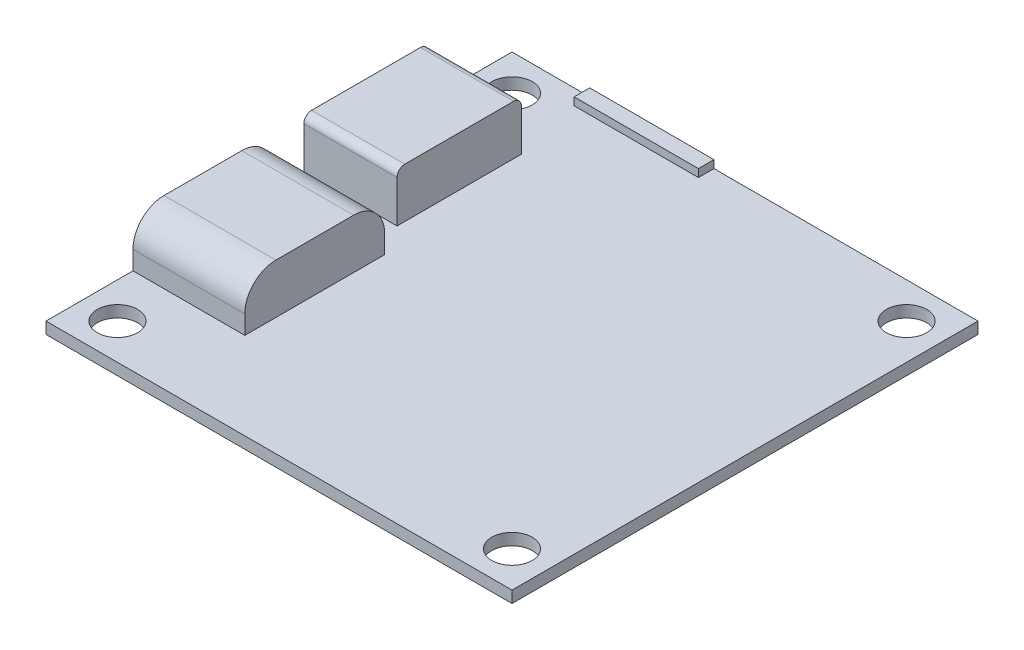
ISO-10303-21;
HEADER;
FILE_DESCRIPTION(('STEP AP214'),'2;1');
FILE_NAME('part.step','',(''),(''),'','','');
FILE_SCHEMA(('AUTOMOTIVE_DESIGN { 1 0 10303 214 1 1 1 1 }'));
ENDSEC;
DATA;
#1=APPLICATION_CONTEXT('core data for automotive mechanical design processes');
#2=APPLICATION_PROTOCOL_DEFINITION('international standard','automotive_design',2000,#1);
#3=PRODUCT_CONTEXT('',#1,'mechanical');
#4=PRODUCT('Part','Part','',(#3));
#5=PRODUCT_RELATED_PRODUCT_CATEGORY('part','',(#4));
#6=PRODUCT_DEFINITION_FORMATION('','',#4);
#7=PRODUCT_DEFINITION_CONTEXT('part definition',#1,'design');
#8=PRODUCT_DEFINITION('design','',#6,#7);
#9=PRODUCT_DEFINITION_SHAPE('','',#8);
#10=(LENGTH_UNIT() NAMED_UNIT(*) SI_UNIT(.MILLI.,.METRE.));
#11=(NAMED_UNIT(*) PLANE_ANGLE_UNIT() SI_UNIT($,.RADIAN.));
#12=(NAMED_UNIT(*) SI_UNIT($,.STERADIAN.) SOLID_ANGLE_UNIT());
#13=UNCERTAINTY_MEASURE_WITH_UNIT(LENGTH_MEASURE(1.E-05),#10,'distance_accuracy_value','');
#14=(GEOMETRIC_REPRESENTATION_CONTEXT(3) GLOBAL_UNCERTAINTY_ASSIGNED_CONTEXT((#13)) GLOBAL_UNIT_ASSIGNED_CONTEXT((#10,
#11,#12)) REPRESENTATION_CONTEXT('',''));
#15=CARTESIAN_POINT('',(0.,0.,0.));
#16=DIRECTION('',(0.,0.,1.));
#17=DIRECTION('',(1.,0.,0.));
#18=AXIS2_PLACEMENT_3D('',#15,#16,#17);
#19=CARTESIAN_POINT('',(0.,0.375,0.));
#20=DIRECTION('',(0.,1.,0.));
#21=DIRECTION('',(0.,0.,1.));
#22=AXIS2_PLACEMENT_3D('',#19,#20,#21);
#23=PLANE('',#22);
#24=CARTESIAN_POINT('',(12.7,0.375,12.7));
#25=DIRECTION('',(0.,1.,0.));
#26=DIRECTION('',(0.,0.,-1.));
#27=AXIS2_PLACEMENT_3D('',#24,#25,#26);
#28=CIRCLE('',#27,1.3);
#29=CARTESIAN_POINT('',(12.7,0.375,11.4));
#30=VERTEX_POINT('',#29);
#31=EDGE_CURVE('E279',#30,#30,#28,.T.);
#32=ORIENTED_EDGE('',*,*,#31,.F.);
#33=EDGE_LOOP('',(#32));
#34=FACE_BOUND('',#33,.T.);
#35=CARTESIAN_POINT('',(-12.7,0.375,12.7));
#36=DIRECTION('',(0.,-1.,0.));
#37=DIRECTION('',(0.,0.,-1.));
#38=AXIS2_PLACEMENT_3D('',#35,#36,#37);
#39=CIRCLE('',#38,1.3);
#40=CARTESIAN_POINT('',(-12.7,0.375,11.4));
#41=VERTEX_POINT('',#40);
#42=EDGE_CURVE('E284',#41,#41,#39,.T.);
#43=ORIENTED_EDGE('',*,*,#42,.T.);
#44=EDGE_LOOP('',(#43));
#45=FACE_BOUND('',#44,.T.);
#46=CARTESIAN_POINT('',(12.7,0.375,-12.7));
#47=DIRECTION('',(0.,-1.,0.));
#48=DIRECTION('',(0.,0.,1.));
#49=AXIS2_PLACEMENT_3D('',#46,#47,#48);
#50=CIRCLE('',#49,1.3);
#51=CARTESIAN_POINT('',(12.7,0.375,-11.4));
#52=VERTEX_POINT('',#51);
#53=EDGE_CURVE('E292',#52,#52,#50,.T.);
#54=ORIENTED_EDGE('',*,*,#53,.T.);
#55=EDGE_LOOP('',(#54));
#56=FACE_BOUND('',#55,.T.);
#57=CARTESIAN_POINT('',(-12.7,0.375,-12.7));
#58=DIRECTION('',(0.,1.,0.));
#59=DIRECTION('',(0.,0.,1.));
#60=AXIS2_PLACEMENT_3D('',#57,#58,#59);
#61=CIRCLE('',#60,1.3);
#62=CARTESIAN_POINT('',(-12.7,0.375,-11.4));
#63=VERTEX_POINT('',#62);
#64=EDGE_CURVE('E300',#63,#63,#61,.T.);
#65=ORIENTED_EDGE('',*,*,#64,.F.);
#66=EDGE_LOOP('',(#65));
#67=FACE_BOUND('',#66,.T.);
#68=DIRECTION('',(-1.,0.,0.));
#69=VECTOR('',#68,1.);
#70=CARTESIAN_POINT('',(0.,0.375,-14.));
#71=LINE('',#70,#69);
#72=CARTESIAN_POINT('',(-1.99999999999999,0.375,-14.));
#73=VERTEX_POINT('',#72);
#74=CARTESIAN_POINT('',(-9.99999999999999,0.375,-14.));
#75=VERTEX_POINT('',#74);
#76=EDGE_CURVE('E11',#73,#75,#71,.T.);
#77=ORIENTED_EDGE('',*,*,#76,.T.);
#78=DIRECTION('',(0.,0.,-1.));
#79=VECTOR('',#78,1.);
#80=CARTESIAN_POINT('',(-9.99999999999999,0.375,0.));
#81=LINE('',#80,#79);
#82=CARTESIAN_POINT('',(-9.99999999999999,0.375,-15.));
#83=VERTEX_POINT('',#82);
#84=EDGE_CURVE('E203',#75,#83,#81,.T.);
#85=ORIENTED_EDGE('',*,*,#84,.T.);
#86=DIRECTION('',(-1.,0.,0.));
#87=VECTOR('',#86,1.);
#88=CARTESIAN_POINT('',(-15.,0.375,-15.));
#89=LINE('',#88,#87);
#90=CARTESIAN_POINT('',(-15.,0.375,-15.));
#91=VERTEX_POINT('',#90);
#92=EDGE_CURVE('E316',#83,#91,#89,.T.);
#93=ORIENTED_EDGE('',*,*,#92,.T.);
#94=DIRECTION('',(0.,0.,1.));
#95=VECTOR('',#94,1.);
#96=CARTESIAN_POINT('',(-15.,0.375,-15.));
#97=LINE('',#96,#95);
#98=CARTESIAN_POINT('',(-15.,0.375,-9.6));
#99=VERTEX_POINT('',#98);
#100=EDGE_CURVE('E322',#91,#99,#97,.T.);
#101=ORIENTED_EDGE('',*,*,#100,.T.);
#102=DIRECTION('',(-1.,0.,0.));
#103=VECTOR('',#102,1.);
#104=CARTESIAN_POINT('',(-15.,0.375,-9.6));
#105=LINE('',#104,#103);
#106=CARTESIAN_POINT('',(-9.,0.375,-9.6));
#107=VERTEX_POINT('',#106);
#108=EDGE_CURVE('E221',#107,#99,#105,.T.);
#109=ORIENTED_EDGE('',*,*,#108,.F.);
#110=DIRECTION('',(0.,0.,-1.));
#111=VECTOR('',#110,1.);
#112=CARTESIAN_POINT('',(-9.,0.375,-1.6));
#113=LINE('',#112,#111);
#114=CARTESIAN_POINT('',(-9.,0.375,-1.6));
#115=VERTEX_POINT('',#114);
#116=EDGE_CURVE('E229',#115,#107,#113,.T.);
#117=ORIENTED_EDGE('',*,*,#116,.F.);
#118=DIRECTION('',(1.,0.,0.));
#119=VECTOR('',#118,1.);
#120=CARTESIAN_POINT('',(-15.,0.375,-1.6));
#121=LINE('',#120,#119);
#122=CARTESIAN_POINT('',(-15.,0.375,-1.6));
#123=VERTEX_POINT('',#122);
#124=EDGE_CURVE('E215',#123,#115,#121,.T.);
#125=ORIENTED_EDGE('',*,*,#124,.F.);
#126=CARTESIAN_POINT('',(-15.,0.375,0.399999999999998));
#127=VERTEX_POINT('',#126);
#128=EDGE_CURVE('E327',#123,#127,#97,.T.);
#129=ORIENTED_EDGE('',*,*,#128,.T.);
#130=DIRECTION('',(-1.,0.,0.));
#131=VECTOR('',#130,1.);
#132=CARTESIAN_POINT('',(-15.,0.375,0.400000000000001));
#133=LINE('',#132,#131);
#134=CARTESIAN_POINT('',(-7.79999999999999,0.375,0.400000000000001));
#135=VERTEX_POINT('',#134);
#136=EDGE_CURVE('E253',#135,#127,#133,.T.);
#137=ORIENTED_EDGE('',*,*,#136,.F.);
#138=DIRECTION('',(0.,0.,-1.));
#139=VECTOR('',#138,1.);
#140=CARTESIAN_POINT('',(-7.79999999999999,0.375,9.4));
#141=LINE('',#140,#139);
#142=CARTESIAN_POINT('',(-7.79999999999999,0.375,9.4));
#143=VERTEX_POINT('',#142);
#144=EDGE_CURVE('E261',#143,#135,#141,.T.);
#145=ORIENTED_EDGE('',*,*,#144,.F.);
#146=DIRECTION('',(1.,0.,0.));
#147=VECTOR('',#146,1.);
#148=CARTESIAN_POINT('',(-15.,0.375,9.4));
#149=LINE('',#148,#147);
#150=CARTESIAN_POINT('',(-15.,0.375,9.39999999999999));
#151=VERTEX_POINT('',#150);
#152=EDGE_CURVE('E247',#151,#143,#149,.T.);
#153=ORIENTED_EDGE('',*,*,#152,.F.);
#154=CARTESIAN_POINT('',(-15.,0.375,15.));
#155=VERTEX_POINT('',#154);
#156=EDGE_CURVE('E321',#151,#155,#97,.T.);
#157=ORIENTED_EDGE('',*,*,#156,.T.);
#158=DIRECTION('',(1.,0.,0.));
#159=VECTOR('',#158,1.);
#160=CARTESIAN_POINT('',(-15.,0.375,15.));
#161=LINE('',#160,#159);
#162=CARTESIAN_POINT('',(15.,0.375,15.));
#163=VERTEX_POINT('',#162);
#164=EDGE_CURVE('E326',#155,#163,#161,.T.);
#165=ORIENTED_EDGE('',*,*,#164,.T.);
#166=DIRECTION('',(0.,0.,-1.));
#167=VECTOR('',#166,1.);
#168=CARTESIAN_POINT('',(15.,0.375,-15.));
#169=LINE('',#168,#167);
#170=CARTESIAN_POINT('',(15.,0.375,-15.));
#171=VERTEX_POINT('',#170);
#172=EDGE_CURVE('E312',#163,#171,#169,.T.);
#173=ORIENTED_EDGE('',*,*,#172,.T.);
#174=CARTESIAN_POINT('',(-2.,0.375,-15.));
#175=VERTEX_POINT('',#174);
#176=EDGE_CURVE('E318',#171,#175,#89,.T.);
#177=ORIENTED_EDGE('',*,*,#176,.T.);
#178=DIRECTION('',(0.,0.,1.));
#179=VECTOR('',#178,1.);
#180=CARTESIAN_POINT('',(-1.99999999999999,0.375,0.));
#181=LINE('',#180,#179);
#182=EDGE_CURVE('E64',#175,#73,#181,.T.);
#183=ORIENTED_EDGE('',*,*,#182,.T.);
#184=EDGE_LOOP('',(#77,#85,#93,#101,#109,#117,#125,#129,#137,#145,#153,#157,#165,#173,#177,#183));
#185=FACE_BOUND('',#184,.T.);
#186=ADVANCED_FACE('F45',(#34,#45,#56,#67,#185),#23,.T.);
#187=CARTESIAN_POINT('',(15.,0.375,-15.));
#188=DIRECTION('',(-1.,0.,0.));
#189=DIRECTION('',(0.,0.,1.));
#190=AXIS2_PLACEMENT_3D('',#187,#188,#189);
#191=PLANE('',#190);
#192=DIRECTION('',(0.,0.,-1.));
#193=VECTOR('',#192,1.);
#194=CARTESIAN_POINT('',(15.,-0.375,-15.));
#195=LINE('',#194,#193);
#196=CARTESIAN_POINT('',(15.,-0.375,15.));
#197=VERTEX_POINT('',#196);
#198=CARTESIAN_POINT('',(15.,-0.375,-15.));
#199=VERTEX_POINT('',#198);
#200=EDGE_CURVE('E308',#197,#199,#195,.T.);
#201=ORIENTED_EDGE('',*,*,#200,.T.);
#202=DIRECTION('',(0.,-1.,0.));
#203=VECTOR('',#202,1.);
#204=CARTESIAN_POINT('',(15.,0.375,-15.));
#205=LINE('',#204,#203);
#206=EDGE_CURVE('E353',#171,#199,#205,.T.);
#207=ORIENTED_EDGE('',*,*,#206,.F.);
#208=ORIENTED_EDGE('',*,*,#172,.F.);
#209=DIRECTION('',(0.,-1.,0.));
#210=VECTOR('',#209,1.);
#211=CARTESIAN_POINT('',(15.,0.375,15.));
#212=LINE('',#211,#210);
#213=EDGE_CURVE('E330',#163,#197,#212,.T.);
#214=ORIENTED_EDGE('',*,*,#213,.T.);
#215=EDGE_LOOP('',(#201,#207,#208,#214));
#216=FACE_BOUND('',#215,.T.);
#217=ADVANCED_FACE('F451',(#216),#191,.F.);
#218=CARTESIAN_POINT('',(-15.,0.375,-15.));
#219=DIRECTION('',(0.,0.,1.));
#220=DIRECTION('',(1.,0.,0.));
#221=AXIS2_PLACEMENT_3D('',#218,#219,#220);
#222=PLANE('',#221);
#223=ORIENTED_EDGE('',*,*,#92,.F.);
#224=DIRECTION('',(0.,-1.,0.));
#225=VECTOR('',#224,1.);
#226=CARTESIAN_POINT('',(-9.99999999999999,0.875,-15.));
#227=LINE('',#226,#225);
#228=CARTESIAN_POINT('',(-9.99999999999999,0.875,-15.));
#229=VERTEX_POINT('',#228);
#230=EDGE_CURVE('E639',#229,#83,#227,.T.);
#231=ORIENTED_EDGE('',*,*,#230,.F.);
#232=DIRECTION('',(-1.,0.,0.));
#233=VECTOR('',#232,1.);
#234=CARTESIAN_POINT('',(-9.99999999999999,0.875,-15.));
#235=LINE('',#234,#233);
#236=CARTESIAN_POINT('',(-1.99999999999999,0.875,-15.));
#237=VERTEX_POINT('',#236);
#238=EDGE_CURVE('E196',#237,#229,#235,.T.);
#239=ORIENTED_EDGE('',*,*,#238,.F.);
#240=DIRECTION('',(0.,-1.,0.));
#241=VECTOR('',#240,1.);
#242=CARTESIAN_POINT('',(-1.99999999999999,0.875,-15.));
#243=LINE('',#242,#241);
#244=EDGE_CURVE('E209',#237,#175,#243,.T.);
#245=ORIENTED_EDGE('',*,*,#244,.T.);
#246=ORIENTED_EDGE('',*,*,#176,.F.);
#247=ORIENTED_EDGE('',*,*,#206,.T.);
#248=DIRECTION('',(-1.,0.,0.));
#249=VECTOR('',#248,1.);
#250=CARTESIAN_POINT('',(-15.,-0.375,-15.));
#251=LINE('',#250,#249);
#252=CARTESIAN_POINT('',(-15.,-0.375,-15.));
#253=VERTEX_POINT('',#252);
#254=EDGE_CURVE('E334',#199,#253,#251,.T.);
#255=ORIENTED_EDGE('',*,*,#254,.T.);
#256=DIRECTION('',(0.,-1.,0.));
#257=VECTOR('',#256,1.);
#258=CARTESIAN_POINT('',(-15.,0.375,-15.));
#259=LINE('',#258,#257);
#260=EDGE_CURVE('E349',#91,#253,#259,.T.);
#261=ORIENTED_EDGE('',*,*,#260,.F.);
#262=EDGE_LOOP('',(#223,#231,#239,#245,#246,#247,#255,#261));
#263=FACE_BOUND('',#262,.T.);
#264=ADVANCED_FACE('F502',(#263),#222,.F.);
#265=CARTESIAN_POINT('',(-15.,0.375,-15.));
#266=DIRECTION('',(1.,0.,0.));
#267=DIRECTION('',(0.,0.,-1.));
#268=AXIS2_PLACEMENT_3D('',#265,#266,#267);
#269=PLANE('',#268);
#270=DIRECTION('',(0.,0.,1.));
#271=VECTOR('',#270,1.);
#272=CARTESIAN_POINT('',(-15.,3.575,-1.6));
#273=LINE('',#272,#271);
#274=CARTESIAN_POINT('',(-15.,3.575,-9.1));
#275=VERTEX_POINT('',#274);
#276=CARTESIAN_POINT('',(-15.,3.575,-2.1));
#277=VERTEX_POINT('',#276);
#278=EDGE_CURVE('E216',#275,#277,#273,.T.);
#279=ORIENTED_EDGE('',*,*,#278,.F.);
#280=CARTESIAN_POINT('',(-15.,3.075,-9.1));
#281=DIRECTION('',(1.,0.,0.));
#282=DIRECTION('',(0.,0.,-1.));
#283=AXIS2_PLACEMENT_3D('',#280,#281,#282);
#284=CIRCLE('',#283,0.5);
#285=CARTESIAN_POINT('',(-15.,3.075,-9.6));
#286=VERTEX_POINT('',#285);
#287=EDGE_CURVE('E394',#275,#286,#284,.F.);
#288=ORIENTED_EDGE('',*,*,#287,.T.);
#289=DIRECTION('',(0.,-1.,0.));
#290=VECTOR('',#289,1.);
#291=CARTESIAN_POINT('',(-15.,3.575,-9.6));
#292=LINE('',#291,#290);
#293=EDGE_CURVE('E225',#286,#99,#292,.T.);
#294=ORIENTED_EDGE('',*,*,#293,.T.);
#295=ORIENTED_EDGE('',*,*,#100,.F.);
#296=ORIENTED_EDGE('',*,*,#260,.T.);
#297=DIRECTION('',(0.,0.,1.));
#298=VECTOR('',#297,1.);
#299=CARTESIAN_POINT('',(-15.,-0.375,-15.));
#300=LINE('',#299,#298);
#301=CARTESIAN_POINT('',(-15.,-0.375,15.));
#302=VERTEX_POINT('',#301);
#303=EDGE_CURVE('E337',#253,#302,#300,.T.);
#304=ORIENTED_EDGE('',*,*,#303,.T.);
#305=DIRECTION('',(0.,-1.,0.));
#306=VECTOR('',#305,1.);
#307=CARTESIAN_POINT('',(-15.,0.375,15.));
#308=LINE('',#307,#306);
#309=EDGE_CURVE('E345',#155,#302,#308,.T.);
#310=ORIENTED_EDGE('',*,*,#309,.F.);
#311=ORIENTED_EDGE('',*,*,#156,.F.);
#312=DIRECTION('',(0.,-1.,0.));
#313=VECTOR('',#312,1.);
#314=CARTESIAN_POINT('',(-15.,3.575,9.4));
#315=LINE('',#314,#313);
#316=CARTESIAN_POINT('',(-15.,1.575,9.4));
#317=VERTEX_POINT('',#316);
#318=EDGE_CURVE('E276',#317,#151,#315,.T.);
#319=ORIENTED_EDGE('',*,*,#318,.F.);
#320=CARTESIAN_POINT('',(-15.,1.575,7.4));
#321=DIRECTION('',(1.,0.,0.));
#322=DIRECTION('',(0.,0.,-1.));
#323=AXIS2_PLACEMENT_3D('',#320,#321,#322);
#324=CIRCLE('',#323,2.);
#325=CARTESIAN_POINT('',(-15.,3.575,7.4));
#326=VERTEX_POINT('',#325);
#327=EDGE_CURVE('E365',#317,#326,#324,.F.);
#328=ORIENTED_EDGE('',*,*,#327,.T.);
#329=DIRECTION('',(0.,0.,1.));
#330=VECTOR('',#329,1.);
#331=CARTESIAN_POINT('',(-15.,3.575,9.4));
#332=LINE('',#331,#330);
#333=CARTESIAN_POINT('',(-15.,3.575,2.4));
#334=VERTEX_POINT('',#333);
#335=EDGE_CURVE('E248',#334,#326,#332,.T.);
#336=ORIENTED_EDGE('',*,*,#335,.F.);
#337=CARTESIAN_POINT('',(-15.,1.575,2.4));
#338=DIRECTION('',(1.,0.,0.));
#339=DIRECTION('',(0.,0.,-1.));
#340=AXIS2_PLACEMENT_3D('',#337,#338,#339);
#341=CIRCLE('',#340,2.);
#342=CARTESIAN_POINT('',(-15.,1.575,0.400000000000001));
#343=VERTEX_POINT('',#342);
#344=EDGE_CURVE('E368',#334,#343,#341,.F.);
#345=ORIENTED_EDGE('',*,*,#344,.T.);
#346=DIRECTION('',(0.,-1.,0.));
#347=VECTOR('',#346,1.);
#348=CARTESIAN_POINT('',(-15.,3.575,0.400000000000001));
#349=LINE('',#348,#347);
#350=EDGE_CURVE('E257',#343,#127,#349,.T.);
#351=ORIENTED_EDGE('',*,*,#350,.T.);
#352=ORIENTED_EDGE('',*,*,#128,.F.);
#353=DIRECTION('',(0.,-1.,0.));
#354=VECTOR('',#353,1.);
#355=CARTESIAN_POINT('',(-15.,3.575,-1.6));
#356=LINE('',#355,#354);
#357=CARTESIAN_POINT('',(-15.,3.075,-1.6));
#358=VERTEX_POINT('',#357);
#359=EDGE_CURVE('E244',#358,#123,#356,.T.);
#360=ORIENTED_EDGE('',*,*,#359,.F.);
#361=CARTESIAN_POINT('',(-15.,3.075,-2.1));
#362=DIRECTION('',(1.,0.,0.));
#363=DIRECTION('',(0.,0.,-1.));
#364=AXIS2_PLACEMENT_3D('',#361,#362,#363);
#365=CIRCLE('',#364,0.5);
#366=EDGE_CURVE('E391',#358,#277,#365,.F.);
#367=ORIENTED_EDGE('',*,*,#366,.T.);
#368=EDGE_LOOP('',(#279,#288,#294,#295,#296,#304,#310,#311,#319,#328,#336,#345,#351,#352,#360,#367));
#369=FACE_BOUND('',#368,.T.);
#370=ADVANCED_FACE('F417',(#369),#269,.F.);
#371=CARTESIAN_POINT('',(-15.,0.375,15.));
#372=DIRECTION('',(0.,0.,-1.));
#373=DIRECTION('',(-1.,0.,0.));
#374=AXIS2_PLACEMENT_3D('',#371,#372,#373);
#375=PLANE('',#374);
#376=DIRECTION('',(1.,0.,0.));
#377=VECTOR('',#376,1.);
#378=CARTESIAN_POINT('',(-15.,-0.375,15.));
#379=LINE('',#378,#377);
#380=EDGE_CURVE('E317',#302,#197,#379,.T.);
#381=ORIENTED_EDGE('',*,*,#380,.T.);
#382=ORIENTED_EDGE('',*,*,#213,.F.);
#383=ORIENTED_EDGE('',*,*,#164,.F.);
#384=ORIENTED_EDGE('',*,*,#309,.T.);
#385=EDGE_LOOP('',(#381,#382,#383,#384));
#386=FACE_BOUND('',#385,.T.);
#387=ADVANCED_FACE('F447',(#386),#375,.F.);
#388=CARTESIAN_POINT('',(0.,-0.375,0.));
#389=DIRECTION('',(0.,1.,0.));
#390=DIRECTION('',(0.,0.,1.));
#391=AXIS2_PLACEMENT_3D('',#388,#389,#390);
#392=PLANE('',#391);
#393=CARTESIAN_POINT('',(12.7,-0.375,12.7));
#394=DIRECTION('',(0.,1.,0.));
#395=DIRECTION('',(0.,0.,-1.));
#396=AXIS2_PLACEMENT_3D('',#393,#394,#395);
#397=CIRCLE('',#396,1.3);
#398=CARTESIAN_POINT('',(12.7,-0.375,11.4));
#399=VERTEX_POINT('',#398);
#400=EDGE_CURVE('E280',#399,#399,#397,.T.);
#401=ORIENTED_EDGE('',*,*,#400,.T.);
#402=EDGE_LOOP('',(#401));
#403=FACE_BOUND('',#402,.T.);
#404=CARTESIAN_POINT('',(-12.7,-0.375,12.7));
#405=DIRECTION('',(0.,-1.,0.));
#406=DIRECTION('',(0.,0.,-1.));
#407=AXIS2_PLACEMENT_3D('',#404,#405,#406);
#408=CIRCLE('',#407,1.3);
#409=CARTESIAN_POINT('',(-12.7,-0.375,11.4));
#410=VERTEX_POINT('',#409);
#411=EDGE_CURVE('E288',#410,#410,#408,.T.);
#412=ORIENTED_EDGE('',*,*,#411,.F.);
#413=EDGE_LOOP('',(#412));
#414=FACE_BOUND('',#413,.T.);
#415=CARTESIAN_POINT('',(12.7,-0.375,-12.7));
#416=DIRECTION('',(0.,-1.,0.));
#417=DIRECTION('',(0.,0.,1.));
#418=AXIS2_PLACEMENT_3D('',#415,#416,#417);
#419=CIRCLE('',#418,1.3);
#420=CARTESIAN_POINT('',(12.7,-0.375,-11.4));
#421=VERTEX_POINT('',#420);
#422=EDGE_CURVE('E296',#421,#421,#419,.T.);
#423=ORIENTED_EDGE('',*,*,#422,.F.);
#424=EDGE_LOOP('',(#423));
#425=FACE_BOUND('',#424,.T.);
#426=CARTESIAN_POINT('',(-12.7,-0.375,-12.7));
#427=DIRECTION('',(0.,1.,0.));
#428=DIRECTION('',(0.,0.,1.));
#429=AXIS2_PLACEMENT_3D('',#426,#427,#428);
#430=CIRCLE('',#429,1.3);
#431=CARTESIAN_POINT('',(-12.7,-0.375,-11.4));
#432=VERTEX_POINT('',#431);
#433=EDGE_CURVE('E304',#432,#432,#430,.T.);
#434=ORIENTED_EDGE('',*,*,#433,.T.);
#435=EDGE_LOOP('',(#434));
#436=FACE_BOUND('',#435,.T.);
#437=ORIENTED_EDGE('',*,*,#200,.F.);
#438=ORIENTED_EDGE('',*,*,#380,.F.);
#439=ORIENTED_EDGE('',*,*,#303,.F.);
#440=ORIENTED_EDGE('',*,*,#254,.F.);
#441=EDGE_LOOP('',(#437,#438,#439,#440));
#442=FACE_BOUND('',#441,.T.);
#443=ADVANCED_FACE('F444',(#403,#414,#425,#436,#442),#392,.F.);
#444=CARTESIAN_POINT('',(-12.7,-0.375,-12.7));
#445=DIRECTION('',(0.,1.,0.));
#446=DIRECTION('',(0.,0.,1.));
#447=AXIS2_PLACEMENT_3D('',#444,#445,#446);
#448=CYLINDRICAL_SURFACE('',#447,1.3);
#449=ORIENTED_EDGE('',*,*,#433,.F.);
#450=EDGE_LOOP('',(#449));
#451=FACE_BOUND('',#450,.T.);
#452=ORIENTED_EDGE('',*,*,#64,.T.);
#453=EDGE_LOOP('',(#452));
#454=FACE_BOUND('',#453,.T.);
#455=ADVANCED_FACE('F508',(#451,#454),#448,.F.);
#456=CARTESIAN_POINT('',(12.7,-0.375,-12.7));
#457=DIRECTION('',(0.,1.,0.));
#458=DIRECTION('',(0.,0.,1.));
#459=AXIS2_PLACEMENT_3D('',#456,#457,#458);
#460=CYLINDRICAL_SURFACE('',#459,1.3);
#461=ORIENTED_EDGE('',*,*,#422,.T.);
#462=EDGE_LOOP('',(#461));
#463=FACE_BOUND('',#462,.T.);
#464=ORIENTED_EDGE('',*,*,#53,.F.);
#465=EDGE_LOOP('',(#464));
#466=FACE_BOUND('',#465,.T.);
#467=ADVANCED_FACE('F687',(#463,#466),#460,.F.);
#468=CARTESIAN_POINT('',(-12.7,-0.375,12.7));
#469=DIRECTION('',(0.,1.,0.));
#470=DIRECTION('',(0.,0.,1.));
#471=AXIS2_PLACEMENT_3D('',#468,#469,#470);
#472=CYLINDRICAL_SURFACE('',#471,1.3);
#473=ORIENTED_EDGE('',*,*,#411,.T.);
#474=EDGE_LOOP('',(#473));
#475=FACE_BOUND('',#474,.T.);
#476=ORIENTED_EDGE('',*,*,#42,.F.);
#477=EDGE_LOOP('',(#476));
#478=FACE_BOUND('',#477,.T.);
#479=ADVANCED_FACE('F491',(#475,#478),#472,.F.);
#480=CARTESIAN_POINT('',(12.7,-0.375,12.7));
#481=DIRECTION('',(0.,1.,0.));
#482=DIRECTION('',(0.,0.,1.));
#483=AXIS2_PLACEMENT_3D('',#480,#481,#482);
#484=CYLINDRICAL_SURFACE('',#483,1.3);
#485=ORIENTED_EDGE('',*,*,#400,.F.);
#486=EDGE_LOOP('',(#485));
#487=FACE_BOUND('',#486,.T.);
#488=ORIENTED_EDGE('',*,*,#31,.T.);
#489=EDGE_LOOP('',(#488));
#490=FACE_BOUND('',#489,.T.);
#491=ADVANCED_FACE('F484',(#487,#490),#484,.F.);
#492=CARTESIAN_POINT('',(-15.,3.575,9.4));
#493=DIRECTION('',(0.,0.,-1.));
#494=DIRECTION('',(-1.,0.,0.));
#495=AXIS2_PLACEMENT_3D('',#492,#493,#494);
#496=PLANE('',#495);
#497=DIRECTION('',(0.,-1.,0.));
#498=VECTOR('',#497,1.);
#499=CARTESIAN_POINT('',(-7.79999999999999,3.575,9.4));
#500=LINE('',#499,#498);
#501=CARTESIAN_POINT('',(-7.79999999999999,1.575,9.4));
#502=VERTEX_POINT('',#501);
#503=EDGE_CURVE('E273',#502,#143,#500,.T.);
#504=ORIENTED_EDGE('',*,*,#503,.F.);
#505=DIRECTION('',(1.,0.,0.));
#506=VECTOR('',#505,1.);
#507=CARTESIAN_POINT('',(-15.,1.575,9.4));
#508=LINE('',#507,#506);
#509=EDGE_CURVE('E380',#502,#317,#508,.F.);
#510=ORIENTED_EDGE('',*,*,#509,.T.);
#511=ORIENTED_EDGE('',*,*,#318,.T.);
#512=ORIENTED_EDGE('',*,*,#152,.T.);
#513=EDGE_LOOP('',(#504,#510,#511,#512));
#514=FACE_BOUND('',#513,.T.);
#515=ADVANCED_FACE('F482',(#514),#496,.F.);
#516=CARTESIAN_POINT('',(-7.79999999999999,3.575,9.4));
#517=DIRECTION('',(-1.,0.,0.));
#518=DIRECTION('',(0.,0.,1.));
#519=AXIS2_PLACEMENT_3D('',#516,#517,#518);
#520=PLANE('',#519);
#521=DIRECTION('',(0.,-1.,0.));
#522=VECTOR('',#521,1.);
#523=CARTESIAN_POINT('',(-7.79999999999999,3.575,0.400000000000001));
#524=LINE('',#523,#522);
#525=CARTESIAN_POINT('',(-7.79999999999999,1.575,0.400000000000001));
#526=VERTEX_POINT('',#525);
#527=EDGE_CURVE('E270',#526,#135,#524,.T.);
#528=ORIENTED_EDGE('',*,*,#527,.F.);
#529=CARTESIAN_POINT('',(-7.79999999999999,1.575,2.4));
#530=DIRECTION('',(-1.,0.,0.));
#531=DIRECTION('',(0.,0.,1.));
#532=AXIS2_PLACEMENT_3D('',#529,#530,#531);
#533=CIRCLE('',#532,2.);
#534=CARTESIAN_POINT('',(-7.79999999999999,3.575,2.4));
#535=VERTEX_POINT('',#534);
#536=EDGE_CURVE('E377',#526,#535,#533,.F.);
#537=ORIENTED_EDGE('',*,*,#536,.T.);
#538=DIRECTION('',(0.,0.,-1.));
#539=VECTOR('',#538,1.);
#540=CARTESIAN_POINT('',(-7.79999999999999,3.575,9.4));
#541=LINE('',#540,#539);
#542=CARTESIAN_POINT('',(-7.79999999999999,3.575,7.4));
#543=VERTEX_POINT('',#542);
#544=EDGE_CURVE('E252',#543,#535,#541,.T.);
#545=ORIENTED_EDGE('',*,*,#544,.F.);
#546=CARTESIAN_POINT('',(-7.79999999999999,1.575,7.4));
#547=DIRECTION('',(-1.,0.,0.));
#548=DIRECTION('',(0.,0.,1.));
#549=AXIS2_PLACEMENT_3D('',#546,#547,#548);
#550=CIRCLE('',#549,2.);
#551=EDGE_CURVE('E374',#543,#502,#550,.F.);
#552=ORIENTED_EDGE('',*,*,#551,.T.);
#553=ORIENTED_EDGE('',*,*,#503,.T.);
#554=ORIENTED_EDGE('',*,*,#144,.T.);
#555=EDGE_LOOP('',(#528,#537,#545,#552,#553,#554));
#556=FACE_BOUND('',#555,.T.);
#557=ADVANCED_FACE('F467',(#556),#520,.F.);
#558=CARTESIAN_POINT('',(-15.,3.575,0.400000000000001));
#559=DIRECTION('',(0.,0.,1.));
#560=DIRECTION('',(1.,0.,0.));
#561=AXIS2_PLACEMENT_3D('',#558,#559,#560);
#562=PLANE('',#561);
#563=ORIENTED_EDGE('',*,*,#350,.F.);
#564=DIRECTION('',(-1.,0.,0.));
#565=VECTOR('',#564,1.);
#566=CARTESIAN_POINT('',(-15.,1.575,0.400000000000001));
#567=LINE('',#566,#565);
#568=EDGE_CURVE('E371',#343,#526,#567,.F.);
#569=ORIENTED_EDGE('',*,*,#568,.T.);
#570=ORIENTED_EDGE('',*,*,#527,.T.);
#571=ORIENTED_EDGE('',*,*,#136,.T.);
#572=EDGE_LOOP('',(#563,#569,#570,#571));
#573=FACE_BOUND('',#572,.T.);
#574=ADVANCED_FACE('F462',(#573),#562,.F.);
#575=CARTESIAN_POINT('',(0.,3.575,0.));
#576=DIRECTION('',(0.,-1.,0.));
#577=DIRECTION('',(0.,0.,-1.));
#578=AXIS2_PLACEMENT_3D('',#575,#576,#577);
#579=PLANE('',#578);
#580=ORIENTED_EDGE('',*,*,#544,.T.);
#581=DIRECTION('',(-1.,0.,0.));
#582=VECTOR('',#581,1.);
#583=CARTESIAN_POINT('',(0.,3.575,2.4));
#584=LINE('',#583,#582);
#585=EDGE_CURVE('E361',#535,#334,#584,.T.);
#586=ORIENTED_EDGE('',*,*,#585,.T.);
#587=ORIENTED_EDGE('',*,*,#335,.T.);
#588=DIRECTION('',(1.,0.,0.));
#589=VECTOR('',#588,1.);
#590=CARTESIAN_POINT('',(0.,3.575,7.4));
#591=LINE('',#590,#589);
#592=EDGE_CURVE('E357',#326,#543,#591,.T.);
#593=ORIENTED_EDGE('',*,*,#592,.T.);
#594=EDGE_LOOP('',(#580,#586,#587,#593));
#595=FACE_BOUND('',#594,.T.);
#596=ADVANCED_FACE('F474',(#595),#579,.F.);
#597=CARTESIAN_POINT('',(-15.,3.575,-1.6));
#598=DIRECTION('',(0.,0.,-1.));
#599=DIRECTION('',(-1.,0.,0.));
#600=AXIS2_PLACEMENT_3D('',#597,#598,#599);
#601=PLANE('',#600);
#602=DIRECTION('',(0.,-1.,0.));
#603=VECTOR('',#602,1.);
#604=CARTESIAN_POINT('',(-9.,3.575,-1.6));
#605=LINE('',#604,#603);
#606=CARTESIAN_POINT('',(-9.,3.075,-1.6));
#607=VERTEX_POINT('',#606);
#608=EDGE_CURVE('E241',#607,#115,#605,.T.);
#609=ORIENTED_EDGE('',*,*,#608,.F.);
#610=DIRECTION('',(1.,0.,0.));
#611=VECTOR('',#610,1.);
#612=CARTESIAN_POINT('',(-15.,3.075,-1.6));
#613=LINE('',#612,#611);
#614=EDGE_CURVE('E54',#607,#358,#613,.F.);
#615=ORIENTED_EDGE('',*,*,#614,.T.);
#616=ORIENTED_EDGE('',*,*,#359,.T.);
#617=ORIENTED_EDGE('',*,*,#124,.T.);
#618=EDGE_LOOP('',(#609,#615,#616,#617));
#619=FACE_BOUND('',#618,.T.);
#620=ADVANCED_FACE('F410',(#619),#601,.F.);
#621=CARTESIAN_POINT('',(-9.,3.575,-1.6));
#622=DIRECTION('',(-1.,0.,0.));
#623=DIRECTION('',(0.,0.,1.));
#624=AXIS2_PLACEMENT_3D('',#621,#622,#623);
#625=PLANE('',#624);
#626=DIRECTION('',(0.,-1.,0.));
#627=VECTOR('',#626,1.);
#628=CARTESIAN_POINT('',(-9.,3.575,-9.6));
#629=LINE('',#628,#627);
#630=CARTESIAN_POINT('',(-9.,3.075,-9.6));
#631=VERTEX_POINT('',#630);
#632=EDGE_CURVE('E238',#631,#107,#629,.T.);
#633=ORIENTED_EDGE('',*,*,#632,.F.);
#634=CARTESIAN_POINT('',(-9.,3.075,-9.1));
#635=DIRECTION('',(-1.,0.,0.));
#636=DIRECTION('',(0.,0.,1.));
#637=AXIS2_PLACEMENT_3D('',#634,#635,#636);
#638=CIRCLE('',#637,0.5);
#639=CARTESIAN_POINT('',(-9.,3.575,-9.1));
#640=VERTEX_POINT('',#639);
#641=EDGE_CURVE('E403',#631,#640,#638,.F.);
#642=ORIENTED_EDGE('',*,*,#641,.T.);
#643=DIRECTION('',(0.,0.,-1.));
#644=VECTOR('',#643,1.);
#645=CARTESIAN_POINT('',(-9.,3.575,-1.6));
#646=LINE('',#645,#644);
#647=CARTESIAN_POINT('',(-9.,3.575,-2.1));
#648=VERTEX_POINT('',#647);
#649=EDGE_CURVE('E220',#648,#640,#646,.T.);
#650=ORIENTED_EDGE('',*,*,#649,.F.);
#651=CARTESIAN_POINT('',(-9.,3.075,-2.1));
#652=DIRECTION('',(-1.,0.,0.));
#653=DIRECTION('',(0.,0.,1.));
#654=AXIS2_PLACEMENT_3D('',#651,#652,#653);
#655=CIRCLE('',#654,0.5);
#656=EDGE_CURVE('E400',#648,#607,#655,.F.);
#657=ORIENTED_EDGE('',*,*,#656,.T.);
#658=ORIENTED_EDGE('',*,*,#608,.T.);
#659=ORIENTED_EDGE('',*,*,#116,.T.);
#660=EDGE_LOOP('',(#633,#642,#650,#657,#658,#659));
#661=FACE_BOUND('',#660,.T.);
#662=ADVANCED_FACE('F426',(#661),#625,.F.);
#663=CARTESIAN_POINT('',(-15.,3.575,-9.6));
#664=DIRECTION('',(0.,0.,1.));
#665=DIRECTION('',(1.,0.,0.));
#666=AXIS2_PLACEMENT_3D('',#663,#664,#665);
#667=PLANE('',#666);
#668=ORIENTED_EDGE('',*,*,#293,.F.);
#669=DIRECTION('',(-1.,0.,0.));
#670=VECTOR('',#669,1.);
#671=CARTESIAN_POINT('',(-15.,3.075,-9.6));
#672=LINE('',#671,#670);
#673=EDGE_CURVE('E397',#286,#631,#672,.F.);
#674=ORIENTED_EDGE('',*,*,#673,.T.);
#675=ORIENTED_EDGE('',*,*,#632,.T.);
#676=ORIENTED_EDGE('',*,*,#108,.T.);
#677=EDGE_LOOP('',(#668,#674,#675,#676));
#678=FACE_BOUND('',#677,.T.);
#679=ADVANCED_FACE('F434',(#678),#667,.F.);
#680=CARTESIAN_POINT('',(0.,3.575,0.));
#681=DIRECTION('',(0.,-1.,0.));
#682=DIRECTION('',(0.,0.,-1.));
#683=AXIS2_PLACEMENT_3D('',#680,#681,#682);
#684=PLANE('',#683);
#685=ORIENTED_EDGE('',*,*,#649,.T.);
#686=DIRECTION('',(-1.,0.,0.));
#687=VECTOR('',#686,1.);
#688=CARTESIAN_POINT('',(0.,3.575,-9.1));
#689=LINE('',#688,#687);
#690=EDGE_CURVE('E387',#640,#275,#689,.T.);
#691=ORIENTED_EDGE('',*,*,#690,.T.);
#692=ORIENTED_EDGE('',*,*,#278,.T.);
#693=DIRECTION('',(1.,0.,0.));
#694=VECTOR('',#693,1.);
#695=CARTESIAN_POINT('',(0.,3.575,-2.1));
#696=LINE('',#695,#694);
#697=EDGE_CURVE('E383',#277,#648,#696,.T.);
#698=ORIENTED_EDGE('',*,*,#697,.T.);
#699=EDGE_LOOP('',(#685,#691,#692,#698));
#700=FACE_BOUND('',#699,.T.);
#701=ADVANCED_FACE('F422',(#700),#684,.F.);
#702=CARTESIAN_POINT('',(0.,1.575,2.4));
#703=DIRECTION('',(-1.,0.,0.));
#704=DIRECTION('',(0.,0.,1.));
#705=AXIS2_PLACEMENT_3D('',#702,#703,#704);
#706=CYLINDRICAL_SURFACE('',#705,2.);
#707=ORIENTED_EDGE('',*,*,#536,.F.);
#708=ORIENTED_EDGE('',*,*,#568,.F.);
#709=ORIENTED_EDGE('',*,*,#344,.F.);
#710=ORIENTED_EDGE('',*,*,#585,.F.);
#711=EDGE_LOOP('',(#707,#708,#709,#710));
#712=FACE_BOUND('',#711,.T.);
#713=ADVANCED_FACE('F471',(#712),#706,.T.);
#714=CARTESIAN_POINT('',(0.,1.575,7.4));
#715=DIRECTION('',(1.,0.,0.));
#716=DIRECTION('',(0.,0.,-1.));
#717=AXIS2_PLACEMENT_3D('',#714,#715,#716);
#718=CYLINDRICAL_SURFACE('',#717,2.);
#719=ORIENTED_EDGE('',*,*,#327,.F.);
#720=ORIENTED_EDGE('',*,*,#509,.F.);
#721=ORIENTED_EDGE('',*,*,#551,.F.);
#722=ORIENTED_EDGE('',*,*,#592,.F.);
#723=EDGE_LOOP('',(#719,#720,#721,#722));
#724=FACE_BOUND('',#723,.T.);
#725=ADVANCED_FACE('F479',(#724),#718,.T.);
#726=CARTESIAN_POINT('',(0.,3.075,-9.1));
#727=DIRECTION('',(-1.,0.,0.));
#728=DIRECTION('',(0.,0.,1.));
#729=AXIS2_PLACEMENT_3D('',#726,#727,#728);
#730=CYLINDRICAL_SURFACE('',#729,0.5);
#731=ORIENTED_EDGE('',*,*,#641,.F.);
#732=ORIENTED_EDGE('',*,*,#673,.F.);
#733=ORIENTED_EDGE('',*,*,#287,.F.);
#734=ORIENTED_EDGE('',*,*,#690,.F.);
#735=EDGE_LOOP('',(#731,#732,#733,#734));
#736=FACE_BOUND('',#735,.T.);
#737=ADVANCED_FACE('F430',(#736),#730,.T.);
#738=CARTESIAN_POINT('',(0.,3.075,-2.1));
#739=DIRECTION('',(1.,0.,0.));
#740=DIRECTION('',(0.,0.,-1.));
#741=AXIS2_PLACEMENT_3D('',#738,#739,#740);
#742=CYLINDRICAL_SURFACE('',#741,0.5);
#743=ORIENTED_EDGE('',*,*,#366,.F.);
#744=ORIENTED_EDGE('',*,*,#614,.F.);
#745=ORIENTED_EDGE('',*,*,#656,.F.);
#746=ORIENTED_EDGE('',*,*,#697,.F.);
#747=EDGE_LOOP('',(#743,#744,#745,#746));
#748=FACE_BOUND('',#747,.T.);
#749=ADVANCED_FACE('F47',(#748),#742,.T.);
#750=CARTESIAN_POINT('',(-9.99999999999999,0.875,-15.));
#751=DIRECTION('',(1.,0.,0.));
#752=DIRECTION('',(0.,0.,-1.));
#753=AXIS2_PLACEMENT_3D('',#750,#751,#752);
#754=PLANE('',#753);
#755=ORIENTED_EDGE('',*,*,#84,.F.);
#756=DIRECTION('',(0.,-1.,0.));
#757=VECTOR('',#756,1.);
#758=CARTESIAN_POINT('',(-9.99999999999999,0.875,-14.));
#759=LINE('',#758,#757);
#760=CARTESIAN_POINT('',(-9.99999999999999,0.875,-14.));
#761=VERTEX_POINT('',#760);
#762=EDGE_CURVE('E184',#761,#75,#759,.T.);
#763=ORIENTED_EDGE('',*,*,#762,.F.);
#764=DIRECTION('',(0.,0.,1.));
#765=VECTOR('',#764,1.);
#766=CARTESIAN_POINT('',(-9.99999999999999,0.875,-15.));
#767=LINE('',#766,#765);
#768=EDGE_CURVE('E191',#229,#761,#767,.T.);
#769=ORIENTED_EDGE('',*,*,#768,.F.);
#770=ORIENTED_EDGE('',*,*,#230,.T.);
#771=EDGE_LOOP('',(#755,#763,#769,#770));
#772=FACE_BOUND('',#771,.T.);
#773=ADVANCED_FACE('F202',(#772),#754,.F.);
#774=CARTESIAN_POINT('',(-9.99999999999999,0.875,-14.));
#775=DIRECTION('',(0.,0.,-1.));
#776=DIRECTION('',(-1.,0.,0.));
#777=AXIS2_PLACEMENT_3D('',#774,#775,#776);
#778=PLANE('',#777);
#779=ORIENTED_EDGE('',*,*,#76,.F.);
#780=DIRECTION('',(0.,-1.,0.));
#781=VECTOR('',#780,1.);
#782=CARTESIAN_POINT('',(-1.99999999999999,0.875,-14.));
#783=LINE('',#782,#781);
#784=CARTESIAN_POINT('',(-1.99999999999999,0.875,-14.));
#785=VERTEX_POINT('',#784);
#786=EDGE_CURVE('E186',#785,#73,#783,.T.);
#787=ORIENTED_EDGE('',*,*,#786,.F.);
#788=DIRECTION('',(1.,0.,0.));
#789=VECTOR('',#788,1.);
#790=CARTESIAN_POINT('',(-9.99999999999999,0.875,-14.));
#791=LINE('',#790,#789);
#792=EDGE_CURVE('E180',#761,#785,#791,.T.);
#793=ORIENTED_EDGE('',*,*,#792,.F.);
#794=ORIENTED_EDGE('',*,*,#762,.T.);
#795=EDGE_LOOP('',(#779,#787,#793,#794));
#796=FACE_BOUND('',#795,.T.);
#797=ADVANCED_FACE('F182',(#796),#778,.F.);
#798=CARTESIAN_POINT('',(-1.99999999999999,0.875,-15.));
#799=DIRECTION('',(-1.,0.,0.));
#800=DIRECTION('',(0.,0.,1.));
#801=AXIS2_PLACEMENT_3D('',#798,#799,#800);
#802=PLANE('',#801);
#803=ORIENTED_EDGE('',*,*,#182,.F.);
#804=ORIENTED_EDGE('',*,*,#244,.F.);
#805=DIRECTION('',(0.,0.,-1.));
#806=VECTOR('',#805,1.);
#807=CARTESIAN_POINT('',(-1.99999999999999,0.875,-15.));
#808=LINE('',#807,#806);
#809=EDGE_CURVE('E190',#785,#237,#808,.T.);
#810=ORIENTED_EDGE('',*,*,#809,.F.);
#811=ORIENTED_EDGE('',*,*,#786,.T.);
#812=EDGE_LOOP('',(#803,#804,#810,#811));
#813=FACE_BOUND('',#812,.T.);
#814=ADVANCED_FACE('F532',(#813),#802,.F.);
#815=CARTESIAN_POINT('',(0.,0.875,0.));
#816=DIRECTION('',(0.,1.,0.));
#817=DIRECTION('',(0.,0.,1.));
#818=AXIS2_PLACEMENT_3D('',#815,#816,#817);
#819=PLANE('',#818);
#820=ORIENTED_EDGE('',*,*,#768,.T.);
#821=ORIENTED_EDGE('',*,*,#792,.T.);
#822=ORIENTED_EDGE('',*,*,#809,.T.);
#823=ORIENTED_EDGE('',*,*,#238,.T.);
#824=EDGE_LOOP('',(#820,#821,#822,#823));
#825=FACE_BOUND('',#824,.T.);
#826=ADVANCED_FACE('F194',(#825),#819,.T.);
#827=CLOSED_SHELL('',(#186,#217,#264,#370,#387,#443,#455,#467,#479,#491,#515,#557,#574,#596,
#620,#662,#679,#701,#713,#725,#737,#749,#773,#797,#814,#826));
#828=MANIFOLD_SOLID_BREP('B2',#827);
#829=ADVANCED_BREP_SHAPE_REPRESENTATION('',(#18,#828),#14);
#830=SHAPE_DEFINITION_REPRESENTATION(#9,#829);
ENDSEC;
END-ISO-10303-21;
